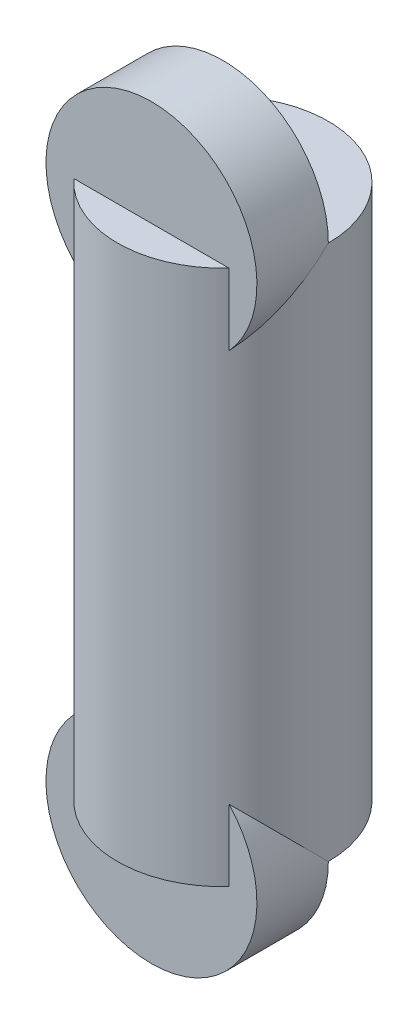
ISO-10303-21;
HEADER;
FILE_DESCRIPTION(('STEP AP214'),'2;1');
FILE_NAME('part.step','',(''),(''),'','','');
FILE_SCHEMA(('AUTOMOTIVE_DESIGN { 1 0 10303 214 1 1 1 1 }'));
ENDSEC;
DATA;
#1=APPLICATION_CONTEXT('core data for automotive mechanical design processes');
#2=APPLICATION_PROTOCOL_DEFINITION('international standard','automotive_design',2000,#1);
#3=PRODUCT_CONTEXT('',#1,'mechanical');
#4=PRODUCT('Part','Part','',(#3));
#5=PRODUCT_RELATED_PRODUCT_CATEGORY('part','',(#4));
#6=PRODUCT_DEFINITION_FORMATION('','',#4);
#7=PRODUCT_DEFINITION_CONTEXT('part definition',#1,'design');
#8=PRODUCT_DEFINITION('design','',#6,#7);
#9=PRODUCT_DEFINITION_SHAPE('','',#8);
#10=(LENGTH_UNIT() NAMED_UNIT(*) SI_UNIT(.MILLI.,.METRE.));
#11=(NAMED_UNIT(*) PLANE_ANGLE_UNIT() SI_UNIT($,.RADIAN.));
#12=(NAMED_UNIT(*) SI_UNIT($,.STERADIAN.) SOLID_ANGLE_UNIT());
#13=UNCERTAINTY_MEASURE_WITH_UNIT(LENGTH_MEASURE(1.E-05),#10,'distance_accuracy_value','');
#14=(GEOMETRIC_REPRESENTATION_CONTEXT(3) GLOBAL_UNCERTAINTY_ASSIGNED_CONTEXT((#13)) GLOBAL_UNIT_ASSIGNED_CONTEXT((#10,
#11,#12)) REPRESENTATION_CONTEXT('',''));
#15=CARTESIAN_POINT('',(0.,0.,0.));
#16=DIRECTION('',(0.,0.,1.));
#17=DIRECTION('',(1.,0.,0.));
#18=AXIS2_PLACEMENT_3D('',#15,#16,#17);
#19=CARTESIAN_POINT('',(0.,46.0659340659341,0.));
#20=DIRECTION('',(0.,1.,0.));
#21=DIRECTION('',(0.,0.,1.));
#22=AXIS2_PLACEMENT_3D('',#19,#20,#21);
#23=CYLINDRICAL_SURFACE('',#22,15.1208791208791);
#24=DIRECTION('',(0.,1.,0.));
#25=VECTOR('',#24,1.);
#26=CARTESIAN_POINT('',(15.1208791208791,46.0659340659341,0.));
#27=LINE('',#26,#25);
#28=CARTESIAN_POINT('',(15.1208791208791,116.065934065934,0.));
#29=VERTEX_POINT('',#28);
#30=CARTESIAN_POINT('',(15.1208791208791,90.6911488516523,0.));
#31=VERTEX_POINT('',#30);
#32=EDGE_CURVE('E221',#29,#31,#27,.F.);
#33=ORIENTED_EDGE('',*,*,#32,.F.);
#34=CARTESIAN_POINT('',(0.,116.065934065934,0.));
#35=DIRECTION('',(0.,1.,0.));
#36=DIRECTION('',(0.,0.,1.));
#37=AXIS2_PLACEMENT_3D('',#34,#35,#36);
#38=CIRCLE('',#37,15.1208791208791);
#39=CARTESIAN_POINT('',(-15.1208791208791,116.065934065934,0.));
#40=VERTEX_POINT('',#39);
#41=EDGE_CURVE('E199',#29,#40,#38,.T.);
#42=ORIENTED_EDGE('',*,*,#41,.T.);
#43=DIRECTION('',(0.,1.,0.));
#44=VECTOR('',#43,1.);
#45=CARTESIAN_POINT('',(-15.1208791208791,46.0659340659341,0.));
#46=LINE('',#45,#44);
#47=CARTESIAN_POINT('',(-15.1208791208791,90.6911488516523,0.));
#48=VERTEX_POINT('',#47);
#49=EDGE_CURVE('E242',#48,#40,#46,.T.);
#50=ORIENTED_EDGE('',*,*,#49,.F.);
#51=CARTESIAN_POINT('',(15.1208791208791,90.6911488516523,0.));
#52=CARTESIAN_POINT('',(15.1208806754029,90.6911535987163,0.197270184569811));
#53=CARTESIAN_POINT('',(15.1170178169914,90.688847432266,0.394512241172447));
#54=CARTESIAN_POINT('',(15.101589618207,90.67966181819,0.788579568573192));
#55=CARTESIAN_POINT('',(15.0900246233496,90.672782575711,0.985404857670053));
#56=CARTESIAN_POINT('',(15.0438426838605,90.6453739109189,1.5743937410107));
#57=CARTESIAN_POINT('',(14.9977386824241,90.6180733811267,1.96542069024204));
#58=CARTESIAN_POINT('',(14.875903839298,90.5466649165317,2.73877195734138));
#59=CARTESIAN_POINT('',(14.8003516640514,90.5026583806942,3.12113431354278));
#60=CARTESIAN_POINT('',(14.6205627374541,90.3994075261834,3.87698953014893));
#61=CARTESIAN_POINT('',(14.5163224569884,90.340161332837,4.25048129317829));
#62=CARTESIAN_POINT('',(14.2806064896987,90.2085726977698,4.985363306735));
#63=CARTESIAN_POINT('',(14.1491953382914,90.136261338457,5.3467799169915));
#64=CARTESIAN_POINT('',(13.8602402984063,89.9806632141203,6.05652911444965));
#65=CARTESIAN_POINT('',(13.7026967861347,89.8973766071015,6.40486188991996));
#66=CARTESIAN_POINT('',(13.3624926299151,89.7220324114235,7.08733821699156));
#67=CARTESIAN_POINT('',(13.1797979993233,89.6299630071833,7.42146175416351));
#68=CARTESIAN_POINT('',(12.7905927452458,89.439473548141,8.07378739381283));
#69=CARTESIAN_POINT('',(12.5840733428763,89.3410511583309,8.39198356509538));
#70=CARTESIAN_POINT('',(12.1296900478013,89.1315851478318,9.03772943943587));
#71=CARTESIAN_POINT('',(11.879798955305,89.0201832944581,9.36373797174608));
#72=CARTESIAN_POINT('',(11.3546883330764,88.7955597852089,9.99401349893743));
#73=CARTESIAN_POINT('',(11.0794674604021,88.6823380331086,10.2982793395368));
#74=CARTESIAN_POINT('',(10.5048971417835,88.456821082367,10.8837683965562));
#75=CARTESIAN_POINT('',(10.2055373073444,88.3445263058264,11.1649815858648));
#76=CARTESIAN_POINT('',(9.58425402079324,88.1236463016022,11.7026396450027));
#77=CARTESIAN_POINT('',(9.26233813855738,88.0150598474193,11.9590927563309));
#78=CARTESIAN_POINT('',(8.57334114107716,87.7965454195539,12.463301923913));
#79=CARTESIAN_POINT('',(8.20467691734837,87.6870834833123,12.7091032500311));
#80=CARTESIAN_POINT('',(7.44500649756936,87.4783888590403,13.168519333292));
#81=CARTESIAN_POINT('',(7.05399893913769,87.3791567958115,13.3821321248493));
#82=CARTESIAN_POINT('',(6.25229685707352,87.1938255538368,13.7749375588821));
#83=CARTESIAN_POINT('',(5.84161223647847,87.1077198582536,13.9541472929501));
#84=CARTESIAN_POINT('',(5.00333362256573,86.9511770256187,14.2761748958135));
#85=CARTESIAN_POINT('',(4.57574153477429,86.8807381287626,14.418996852201));
#86=CARTESIAN_POINT('',(3.73926456615015,86.7622886656204,14.6572086780679));
#87=CARTESIAN_POINT('',(3.33133599981169,86.7130043542708,14.7553259294967));
#88=CARTESIAN_POINT('',(2.5071029786309,86.6311484746811,14.917499548565));
#89=CARTESIAN_POINT('',(2.09079890305109,86.5985761514457,14.9815574549041));
#90=CARTESIAN_POINT('',(1.25351336278734,86.5511047043896,15.0747150533692));
#91=CARTESIAN_POINT('',(0.832534453997687,86.5361963610634,15.1038329821048));
#92=CARTESIAN_POINT('',(-0.0106244412038454,86.5244663981938,15.126754268031));
#93=CARTESIAN_POINT('',(-0.432804347634086,86.5276436011615,15.1205599242842));
#94=CARTESIAN_POINT('',(-1.23622342271919,86.5508703149209,15.0751310819046));
#95=CARTESIAN_POINT('',(-1.61768590587035,86.5693551171164,15.03896044218));
#96=CARTESIAN_POINT('',(-2.37578918126381,86.6207197185814,14.9379656558051));
#97=CARTESIAN_POINT('',(-2.75243032778531,86.6535984538402,14.873143627084));
#98=CARTESIAN_POINT('',(-3.49834956875793,86.7329669640238,14.7155652371847));
#99=CARTESIAN_POINT('',(-3.86762755939533,86.7794569307096,14.6228084824491));
#100=CARTESIAN_POINT('',(-4.59649850157084,86.8849723119577,14.4103193472919));
#101=CARTESIAN_POINT('',(-4.95609109788131,86.9439981855913,14.2905859789632));
#102=CARTESIAN_POINT('',(-5.66818139694421,87.0741220289376,14.0235235880615));
#103=CARTESIAN_POINT('',(-6.02052291493882,87.1453689875159,13.8758513467822));
#104=CARTESIAN_POINT('',(-6.71126236286397,87.2978132182824,13.5552548137961));
#105=CARTESIAN_POINT('',(-7.04966031682189,87.3790104733233,13.3823305656056));
#106=CARTESIAN_POINT('',(-7.71095819944778,87.5496498689415,13.0125189807379));
#107=CARTESIAN_POINT('',(-8.03385640281879,87.639092924148,12.8156289849875));
#108=CARTESIAN_POINT('',(-8.66285235860811,87.8244175748868,12.3991257851831));
#109=CARTESIAN_POINT('',(-8.9689440085661,87.9203014813609,12.1795044097853));
#110=CARTESIAN_POINT('',(-9.59202128292905,88.1261466475454,11.6963380590945));
#111=CARTESIAN_POINT('',(-9.90715485505273,88.2365685327098,11.430598210718));
#112=CARTESIAN_POINT('',(-10.5141883889724,88.4601881592751,10.874842418561));
#113=CARTESIAN_POINT('',(-10.8060866992223,88.5733860972492,10.5848247521308));
#114=CARTESIAN_POINT('',(-11.3656062216909,88.7999313473224,9.98165221320963));
#115=CARTESIAN_POINT('',(-11.6332002719128,88.9132786863456,9.66847214683058));
#116=CARTESIAN_POINT('',(-12.1423095420041,89.1370956299422,9.02080484978199));
#117=CARTESIAN_POINT('',(-12.3838335004098,89.247566189315,8.68632481887718));
#118=CARTESIAN_POINT('',(-12.8554498221742,89.4702426601823,7.97330754501734));
#119=CARTESIAN_POINT('',(-13.0835617150461,89.5820297141027,7.59332505454415));
#120=CARTESIAN_POINT('',(-13.5066174904971,89.7952631653124,6.8124484882458));
#121=CARTESIAN_POINT('',(-13.701556847558,89.8967081509434,6.41155156892985));
#122=CARTESIAN_POINT('',(-14.0558684990173,90.0852972924062,5.59216788121654));
#123=CARTESIAN_POINT('',(-14.2153184046569,90.1724725416929,5.17372192216725));
#124=CARTESIAN_POINT('',(-14.4971594314018,90.3292061974674,4.32141147463379));
#125=CARTESIAN_POINT('',(-14.6195664852651,90.3987721758892,3.88755370501067));
#126=CARTESIAN_POINT('',(-14.7882169518892,90.4957361440433,3.16743636248387));
#127=CARTESIAN_POINT('',(-14.845987601426,90.5292805767428,2.88464460503212));
#128=CARTESIAN_POINT('',(-14.9453508612633,90.5873056010711,2.31536445027528));
#129=CARTESIAN_POINT('',(-14.9869479699366,90.6117887128482,2.02887710376657));
#130=CARTESIAN_POINT('',(-15.0537321122866,90.6512246962112,1.45271476792646));
#131=CARTESIAN_POINT('',(-15.0788835547367,90.6661568964849,1.16303423563829));
#132=CARTESIAN_POINT('',(-15.1124720715017,90.6861396976552,0.582241438493384));
#133=CARTESIAN_POINT('',(-15.1209018466326,90.691185983234,0.291128603979581));
#134=CARTESIAN_POINT('',(-15.1208791208791,90.6911488516523,0.));
#135=B_SPLINE_CURVE_WITH_KNOTS('',3,(#51,#52,#53,#54,#55,#56,#57,#58,#59,#60,#61,#62,#63,#64,
#65,#66,#67,#68,#69,#70,#71,#72,#73,#74,#75,#76,#77,#78,#79,#80,#81,#82,#83,#84,#85,#86,#87,#88,
#89,#90,#91,#92,#93,#94,#95,#96,#97,#98,#99,#100,#101,#102,#103,#104,#105,#106,#107,#108,#109,
#110,#111,#112,#113,#114,#115,#116,#117,#118,#119,#120,#121,#122,#123,#124,#125,#126,#127,#128,
#129,#130,#131,#132,#133,#134),.UNSPECIFIED.,.F.,.F.,(4,2,2,2,2,2,2,2,2,2,2,2,2,2,2,2,2,2,2,2,2,
2,2,2,2,2,2,2,2,2,2,2,2,2,2,2,2,2,2,2,2,4),(0.,0.591703736424877,1.1833809309867,
2.36568822259329,3.54093122300126,4.71631886255657,5.88894618341301,7.06155662438543,
8.23576745527521,9.4104123463778,10.685874422851,11.9614041611657,13.2374857993325,
14.5131412131933,15.880618350303,17.2481789582823,18.6150583877489,19.9817842021362,
21.2473982638022,22.5129551439412,23.7778511902421,25.0426648843838,26.1921617830446,
27.3415737243571,28.4910018598757,29.6404720952973,30.8051067957988,31.9697394893317,
33.1345015204178,34.2996837172167,35.5785769298283,36.8575609642495,38.1379572182442,
39.4179229496306,40.787395478572,42.1570546864239,43.5236885206596,44.8897337043334,
45.7609105923679,46.6318450049651,47.5046580838903,48.3778520711557),.UNSPECIFIED.);
#136=EDGE_CURVE('E191',#31,#48,#135,.T.);
#137=ORIENTED_EDGE('',*,*,#136,.F.);
#138=EDGE_LOOP('',(#33,#42,#50,#137));
#139=FACE_BOUND('',#138,.T.);
#140=DIRECTION('',(0.,1.,0.));
#141=VECTOR('',#140,1.);
#142=CARTESIAN_POINT('',(15.1208791208791,46.0659340659341,0.));
#143=LINE('',#142,#141);
#144=CARTESIAN_POINT('',(15.1208791208791,-8.55928071978414,0.));
#145=VERTEX_POINT('',#144);
#146=CARTESIAN_POINT('',(15.1208791208791,-33.9340659340659,0.));
#147=VERTEX_POINT('',#146);
#148=EDGE_CURVE('E52',#145,#147,#143,.F.);
#149=ORIENTED_EDGE('',*,*,#148,.F.);
#150=CARTESIAN_POINT('',(-15.1208791208791,-8.55928071978414,0.));
#151=CARTESIAN_POINT('',(-15.1208806754029,-8.55928546684811,0.197270184569811));
#152=CARTESIAN_POINT('',(-15.1170178169914,-8.55697930039786,0.394512241172447));
#153=CARTESIAN_POINT('',(-15.101589618207,-8.54779368632182,0.788579568573193));
#154=CARTESIAN_POINT('',(-15.0900246233496,-8.54091444384287,0.985404857670054));
#155=CARTESIAN_POINT('',(-15.0438426838605,-8.51350577905078,1.5743937410107));
#156=CARTESIAN_POINT('',(-14.9977386824241,-8.4862052492586,1.96542069024205));
#157=CARTESIAN_POINT('',(-14.875903839298,-8.41479678466359,2.73877195734138));
#158=CARTESIAN_POINT('',(-14.8003516640514,-8.37079024882603,3.12113431354278));
#159=CARTESIAN_POINT('',(-14.6205627374541,-8.26753939431525,3.87698953014893));
#160=CARTESIAN_POINT('',(-14.5163224569884,-8.20829320096884,4.25048129317829));
#161=CARTESIAN_POINT('',(-14.2806064896987,-8.07670456590167,4.985363306735));
#162=CARTESIAN_POINT('',(-14.1491953382914,-8.00439320658889,5.3467799169915));
#163=CARTESIAN_POINT('',(-13.8602402984063,-7.84879508225216,6.05652911444965));
#164=CARTESIAN_POINT('',(-13.7026967861347,-7.76550847523335,6.40486188991996));
#165=CARTESIAN_POINT('',(-13.3624926299151,-7.59016427955538,7.08733821699156));
#166=CARTESIAN_POINT('',(-13.1797979993233,-7.49809487531519,7.42146175416351));
#167=CARTESIAN_POINT('',(-12.7905927452458,-7.30760541627287,8.07378739381283));
#168=CARTESIAN_POINT('',(-12.5840733428763,-7.2091830264627,8.39198356509538));
#169=CARTESIAN_POINT('',(-12.1296900478013,-6.99971701596368,9.03772943943587));
#170=CARTESIAN_POINT('',(-11.879798955305,-6.8883151625899,9.36373797174608));
#171=CARTESIAN_POINT('',(-11.3546883330764,-6.66369165334077,9.99401349893743));
#172=CARTESIAN_POINT('',(-11.0794674604021,-6.55046990124043,10.2982793395368));
#173=CARTESIAN_POINT('',(-10.5048971417835,-6.3249529504989,10.8837683965562));
#174=CARTESIAN_POINT('',(-10.2055373073444,-6.21265817395825,11.1649815858648));
#175=CARTESIAN_POINT('',(-9.58425402079325,-5.99177816973404,11.7026396450027));
#176=CARTESIAN_POINT('',(-9.26233813855739,-5.88319171555116,11.9590927563309));
#177=CARTESIAN_POINT('',(-8.57334114107716,-5.66467728768578,12.463301923913));
#178=CARTESIAN_POINT('',(-8.20467691734837,-5.55521535144419,12.7091032500311));
#179=CARTESIAN_POINT('',(-7.44500649756937,-5.34652072717217,13.168519333292));
#180=CARTESIAN_POINT('',(-7.0539989391377,-5.24728866394337,13.3821321248493));
#181=CARTESIAN_POINT('',(-6.25229685707352,-5.06195742196867,13.7749375588821));
#182=CARTESIAN_POINT('',(-5.84161223647847,-4.9758517263855,13.9541472929501));
#183=CARTESIAN_POINT('',(-5.00333362256573,-4.81930889375057,14.2761748958135));
#184=CARTESIAN_POINT('',(-4.57574153477429,-4.74886999689448,14.418996852201));
#185=CARTESIAN_POINT('',(-3.73926456615015,-4.63042053375224,14.6572086780679));
#186=CARTESIAN_POINT('',(-3.33133599981169,-4.58113622240261,14.7553259294967));
#187=CARTESIAN_POINT('',(-2.5071029786309,-4.49928034281298,14.917499548565));
#188=CARTESIAN_POINT('',(-2.09079890305109,-4.46670801957755,14.9815574549041));
#189=CARTESIAN_POINT('',(-1.25351336278734,-4.41923657252143,15.0747150533692));
#190=CARTESIAN_POINT('',(-0.832534453997685,-4.40432822919526,15.1038329821048));
#191=CARTESIAN_POINT('',(0.0106244412038467,-4.3925982663256,15.126754268031));
#192=CARTESIAN_POINT('',(0.432804347634087,-4.39577546929339,15.1205599242842));
#193=CARTESIAN_POINT('',(1.23622342271919,-4.41900218305271,15.0751310819046));
#194=CARTESIAN_POINT('',(1.61768590587035,-4.43748698524829,15.03896044218));
#195=CARTESIAN_POINT('',(2.3757891812638,-4.48885158671326,14.9379656558051));
#196=CARTESIAN_POINT('',(2.75243032778531,-4.52173032197209,14.873143627084));
#197=CARTESIAN_POINT('',(3.49834956875792,-4.60109883215563,14.7155652371847));
#198=CARTESIAN_POINT('',(3.86762755939533,-4.64758879884143,14.6228084824491));
#199=CARTESIAN_POINT('',(4.59649850157084,-4.75310418008957,14.4103193472919));
#200=CARTESIAN_POINT('',(4.95609109788132,-4.81213005372321,14.2905859789632));
#201=CARTESIAN_POINT('',(5.66818139694421,-4.94225389706944,14.0235235880615));
#202=CARTESIAN_POINT('',(6.02052291493882,-5.01350085564778,13.8758513467822));
#203=CARTESIAN_POINT('',(6.71126236286397,-5.16594508641422,13.5552548137961));
#204=CARTESIAN_POINT('',(7.04966031682189,-5.24714234145513,13.3823305656056));
#205=CARTESIAN_POINT('',(7.71095819944779,-5.41778173707334,13.0125189807379));
#206=CARTESIAN_POINT('',(8.0338564028188,-5.50722479227981,12.8156289849875));
#207=CARTESIAN_POINT('',(8.66285235860812,-5.69254944301861,12.3991257851831));
#208=CARTESIAN_POINT('',(8.9689440085661,-5.78843334949275,12.1795044097853));
#209=CARTESIAN_POINT('',(9.59202128292906,-5.99427851567723,11.6963380590945));
#210=CARTESIAN_POINT('',(9.90715485505273,-6.10470040084161,11.430598210718));
#211=CARTESIAN_POINT('',(10.5141883889724,-6.32832002740695,10.874842418561));
#212=CARTESIAN_POINT('',(10.8060866992223,-6.44151796538107,10.5848247521308));
#213=CARTESIAN_POINT('',(11.3656062216909,-6.66806321545423,9.98165221320963));
#214=CARTESIAN_POINT('',(11.6332002719128,-6.78141055447745,9.66847214683058));
#215=CARTESIAN_POINT('',(12.1423095420041,-7.00522749807404,9.020804849782));
#216=CARTESIAN_POINT('',(12.3838335004098,-7.11569805744686,8.68632481887718));
#217=CARTESIAN_POINT('',(12.8554498221742,-7.33837452831415,7.97330754501734));
#218=CARTESIAN_POINT('',(13.0835617150461,-7.45016158223459,7.59332505454414));
#219=CARTESIAN_POINT('',(13.5066174904971,-7.66339503344427,6.8124484882458));
#220=CARTESIAN_POINT('',(13.701556847558,-7.76484001907528,6.41155156892984));
#221=CARTESIAN_POINT('',(14.0558684990173,-7.95342916053805,5.59216788121653));
#222=CARTESIAN_POINT('',(14.2153184046569,-8.04060440982473,5.17372192216724));
#223=CARTESIAN_POINT('',(14.4971594314018,-8.19733806559926,4.32141147463379));
#224=CARTESIAN_POINT('',(14.6195664852651,-8.26690404402109,3.88755370501067));
#225=CARTESIAN_POINT('',(14.7882169518892,-8.3638680121752,3.16743636248387));
#226=CARTESIAN_POINT('',(14.845987601426,-8.39741244487464,2.88464460503211));
#227=CARTESIAN_POINT('',(14.9453508612633,-8.45543746920291,2.31536445027527));
#228=CARTESIAN_POINT('',(14.9869479699366,-8.47992058098007,2.02887710376657));
#229=CARTESIAN_POINT('',(15.0537321122866,-8.51935656434306,1.45271476792645));
#230=CARTESIAN_POINT('',(15.0788835547367,-8.5342887646168,1.16303423563829));
#231=CARTESIAN_POINT('',(15.1124720715017,-8.55427156578711,0.582241438493384));
#232=CARTESIAN_POINT('',(15.1209018466326,-8.55931785136585,0.291128603979582));
#233=CARTESIAN_POINT('',(15.1208791208791,-8.55928071978414,0.));
#234=B_SPLINE_CURVE_WITH_KNOTS('',3,(#150,#151,#152,#153,#154,#155,#156,#157,#158,#159,#160,
#161,#162,#163,#164,#165,#166,#167,#168,#169,#170,#171,#172,#173,#174,#175,#176,#177,#178,#179,
#180,#181,#182,#183,#184,#185,#186,#187,#188,#189,#190,#191,#192,#193,#194,#195,#196,#197,#198,
#199,#200,#201,#202,#203,#204,#205,#206,#207,#208,#209,#210,#211,#212,#213,#214,#215,#216,#217,
#218,#219,#220,#221,#222,#223,#224,#225,#226,#227,#228,#229,#230,#231,#232,#233),.UNSPECIFIED.,
.F.,.F.,(4,2,2,2,2,2,2,2,2,2,2,2,2,2,2,2,2,2,2,2,2,2,2,2,2,2,2,2,2,2,2,2,2,2,2,2,2,2,2,2,2,4),
(0.,0.591703736424877,1.1833809309867,2.36568822259329,3.54093122300126,4.71631886255657,
5.88894618341301,7.06155662438543,8.23576745527521,9.4104123463778,10.685874422851,
11.9614041611657,13.2374857993325,14.5131412131933,15.880618350303,17.2481789582823,
18.6150583877489,19.9817842021362,21.2473982638022,22.5129551439412,23.7778511902421,
25.0426648843838,26.1921617830446,27.3415737243571,28.4910018598757,29.6404720952973,
30.8051067957988,31.9697394893317,33.1345015204179,34.2996837172167,35.5785769298283,
36.8575609642495,38.1379572182442,39.4179229496306,40.787395478572,42.157054686424,
43.5236885206596,44.8897337043334,45.7609105923679,46.6318450049651,47.5046580838903,
48.3778520711557),.UNSPECIFIED.);
#235=CARTESIAN_POINT('',(-15.1208791208791,-8.55928071978414,0.));
#236=VERTEX_POINT('',#235);
#237=EDGE_CURVE('E56',#236,#145,#234,.T.);
#238=ORIENTED_EDGE('',*,*,#237,.F.);
#239=DIRECTION('',(0.,1.,0.));
#240=VECTOR('',#239,1.);
#241=CARTESIAN_POINT('',(-15.1208791208791,46.0659340659341,0.));
#242=LINE('',#241,#240);
#243=CARTESIAN_POINT('',(-15.1208791208791,-33.9340659340659,0.));
#244=VERTEX_POINT('',#243);
#245=EDGE_CURVE('E149',#244,#236,#242,.T.);
#246=ORIENTED_EDGE('',*,*,#245,.F.);
#247=CARTESIAN_POINT('',(0.,-33.9340659340659,0.));
#248=DIRECTION('',(0.,1.,0.));
#249=DIRECTION('',(0.,0.,1.));
#250=AXIS2_PLACEMENT_3D('',#247,#248,#249);
#251=CIRCLE('',#250,15.1208791208791);
#252=EDGE_CURVE('E120',#147,#244,#251,.T.);
#253=ORIENTED_EDGE('',*,*,#252,.F.);
#254=EDGE_LOOP('',(#149,#238,#246,#253));
#255=FACE_BOUND('',#254,.T.);
#256=ADVANCED_FACE('F37',(#139,#255),#23,.F.);
#257=CARTESIAN_POINT('',(0.,46.0659340659341,0.));
#258=DIRECTION('',(0.,1.,0.));
#259=DIRECTION('',(0.,0.,1.));
#260=AXIS2_PLACEMENT_3D('',#257,#258,#259);
#261=CYLINDRICAL_SURFACE('',#260,29.5384615384615);
#262=CARTESIAN_POINT('',(0.,116.065934065934,0.));
#263=DIRECTION('',(0.,0.707106781186547,0.707106781186547));
#264=DIRECTION('',(0.,0.707106781186547,-0.707106781186547));
#265=AXIS2_PLACEMENT_3D('',#262,#263,#264);
#266=ELLIPSE('',#265,41.7736929193283,29.5384615384615);
#267=CARTESIAN_POINT('',(21.7375414906831,96.0659340659341,20.));
#268=VERTEX_POINT('',#267);
#269=CARTESIAN_POINT('',(29.5384615384615,116.065934065934,0.));
#270=VERTEX_POINT('',#269);
#271=EDGE_CURVE('E201',#268,#270,#266,.T.);
#272=ORIENTED_EDGE('',*,*,#271,.F.);
#273=DIRECTION('',(0.,1.,0.));
#274=VECTOR('',#273,1.);
#275=CARTESIAN_POINT('',(21.7375414906831,46.0659340659341,20.));
#276=LINE('',#275,#274);
#277=CARTESIAN_POINT('',(21.7375414906831,116.065934065934,20.));
#278=VERTEX_POINT('',#277);
#279=EDGE_CURVE('E237',#268,#278,#276,.T.);
#280=ORIENTED_EDGE('',*,*,#279,.T.);
#281=CARTESIAN_POINT('',(0.,116.065934065934,0.));
#282=DIRECTION('',(0.,1.,0.));
#283=DIRECTION('',(0.,0.,1.));
#284=AXIS2_PLACEMENT_3D('',#281,#282,#283);
#285=CIRCLE('',#284,29.5384615384615);
#286=CARTESIAN_POINT('',(-21.7375414906831,116.065934065934,20.));
#287=VERTEX_POINT('',#286);
#288=EDGE_CURVE('E205',#287,#278,#285,.T.);
#289=ORIENTED_EDGE('',*,*,#288,.F.);
#290=DIRECTION('',(0.,1.,0.));
#291=VECTOR('',#290,1.);
#292=CARTESIAN_POINT('',(-21.7375414906831,46.0659340659341,20.));
#293=LINE('',#292,#291);
#294=CARTESIAN_POINT('',(-21.7375414906831,96.0659340659341,20.));
#295=VERTEX_POINT('',#294);
#296=EDGE_CURVE('E238',#287,#295,#293,.F.);
#297=ORIENTED_EDGE('',*,*,#296,.T.);
#298=CARTESIAN_POINT('',(-29.5384615384615,116.065934065934,0.));
#299=VERTEX_POINT('',#298);
#300=EDGE_CURVE('E200',#299,#295,#266,.T.);
#301=ORIENTED_EDGE('',*,*,#300,.F.);
#302=EDGE_CURVE('E207',#270,#299,#285,.T.);
#303=ORIENTED_EDGE('',*,*,#302,.F.);
#304=EDGE_LOOP('',(#272,#280,#289,#297,#301,#303));
#305=FACE_BOUND('',#304,.T.);
#306=CARTESIAN_POINT('',(0.,-33.9340659340659,0.));
#307=DIRECTION('',(0.,0.707106781186547,-0.707106781186547));
#308=DIRECTION('',(0.,0.707106781186547,0.707106781186547));
#309=AXIS2_PLACEMENT_3D('',#306,#307,#308);
#310=ELLIPSE('',#309,41.7736929193283,29.5384615384615);
#311=CARTESIAN_POINT('',(29.5384615384615,-33.9340659340659,0.));
#312=VERTEX_POINT('',#311);
#313=CARTESIAN_POINT('',(21.7375414906831,-13.9340659340659,20.));
#314=VERTEX_POINT('',#313);
#315=EDGE_CURVE('E124',#312,#314,#310,.F.);
#316=ORIENTED_EDGE('',*,*,#315,.F.);
#317=CARTESIAN_POINT('',(0.,-33.9340659340659,0.));
#318=DIRECTION('',(0.,1.,0.));
#319=DIRECTION('',(0.,0.,1.));
#320=AXIS2_PLACEMENT_3D('',#317,#318,#319);
#321=CIRCLE('',#320,29.5384615384615);
#322=CARTESIAN_POINT('',(-29.5384615384615,-33.9340659340659,0.));
#323=VERTEX_POINT('',#322);
#324=EDGE_CURVE('E111',#312,#323,#321,.T.);
#325=ORIENTED_EDGE('',*,*,#324,.T.);
#326=CARTESIAN_POINT('',(-21.7375414906831,-13.9340659340659,20.));
#327=VERTEX_POINT('',#326);
#328=EDGE_CURVE('E133',#327,#323,#310,.F.);
#329=ORIENTED_EDGE('',*,*,#328,.F.);
#330=DIRECTION('',(0.,1.,0.));
#331=VECTOR('',#330,1.);
#332=CARTESIAN_POINT('',(-21.7375414906831,46.0659340659341,20.));
#333=LINE('',#332,#331);
#334=CARTESIAN_POINT('',(-21.7375414906831,-33.9340659340659,20.));
#335=VERTEX_POINT('',#334);
#336=EDGE_CURVE('E151',#327,#335,#333,.F.);
#337=ORIENTED_EDGE('',*,*,#336,.T.);
#338=CARTESIAN_POINT('',(21.7375414906831,-33.9340659340659,20.));
#339=VERTEX_POINT('',#338);
#340=EDGE_CURVE('E121',#335,#339,#321,.T.);
#341=ORIENTED_EDGE('',*,*,#340,.T.);
#342=DIRECTION('',(0.,1.,0.));
#343=VECTOR('',#342,1.);
#344=CARTESIAN_POINT('',(21.7375414906831,46.0659340659341,20.));
#345=LINE('',#344,#343);
#346=EDGE_CURVE('E128',#339,#314,#345,.T.);
#347=ORIENTED_EDGE('',*,*,#346,.T.);
#348=EDGE_LOOP('',(#316,#325,#329,#337,#341,#347));
#349=FACE_BOUND('',#348,.T.);
#350=ADVANCED_FACE('F125',(#305,#349),#261,.T.);
#351=CARTESIAN_POINT('',(15.1208791208791,-33.9340659340659,0.));
#352=DIRECTION('',(0.,1.,0.));
#353=DIRECTION('',(0.,0.,1.));
#354=AXIS2_PLACEMENT_3D('',#351,#352,#353);
#355=PLANE('',#354);
#356=DIRECTION('',(1.,0.,0.));
#357=VECTOR('',#356,1.);
#358=CARTESIAN_POINT('',(15.1208791208791,-33.9340659340659,0.));
#359=LINE('',#358,#357);
#360=EDGE_CURVE('E45',#323,#244,#359,.T.);
#361=ORIENTED_EDGE('',*,*,#360,.F.);
#362=ORIENTED_EDGE('',*,*,#324,.F.);
#363=EDGE_CURVE('E116',#147,#312,#359,.T.);
#364=ORIENTED_EDGE('',*,*,#363,.F.);
#365=ORIENTED_EDGE('',*,*,#252,.T.);
#366=EDGE_LOOP('',(#361,#362,#364,#365));
#367=FACE_BOUND('',#366,.T.);
#368=ADVANCED_FACE('F113',(#367),#355,.F.);
#369=CARTESIAN_POINT('',(15.1208791208791,116.065934065934,0.));
#370=DIRECTION('',(0.,-1.,0.));
#371=DIRECTION('',(0.,0.,-1.));
#372=AXIS2_PLACEMENT_3D('',#369,#370,#371);
#373=PLANE('',#372);
#374=DIRECTION('',(-1.,0.,0.));
#375=VECTOR('',#374,1.);
#376=CARTESIAN_POINT('',(15.1208791208791,116.065934065934,0.));
#377=LINE('',#376,#375);
#378=EDGE_CURVE('E213',#270,#29,#377,.T.);
#379=ORIENTED_EDGE('',*,*,#378,.F.);
#380=ORIENTED_EDGE('',*,*,#302,.T.);
#381=EDGE_CURVE('E210',#40,#299,#377,.T.);
#382=ORIENTED_EDGE('',*,*,#381,.F.);
#383=ORIENTED_EDGE('',*,*,#41,.F.);
#384=EDGE_LOOP('',(#379,#380,#382,#383));
#385=FACE_BOUND('',#384,.T.);
#386=ADVANCED_FACE('F228',(#385),#373,.F.);
#387=ORIENTED_EDGE('',*,*,#340,.F.);
#388=DIRECTION('',(1.,0.,0.));
#389=VECTOR('',#388,1.);
#390=CARTESIAN_POINT('',(15.1208791208791,-33.9340659340659,20.));
#391=LINE('',#390,#389);
#392=EDGE_CURVE('E11',#335,#339,#391,.T.);
#393=ORIENTED_EDGE('',*,*,#392,.T.);
#394=EDGE_LOOP('',(#387,#393));
#395=FACE_BOUND('',#394,.T.);
#396=ADVANCED_FACE('F252',(#395),#355,.F.);
#397=ORIENTED_EDGE('',*,*,#288,.T.);
#398=DIRECTION('',(-1.,0.,0.));
#399=VECTOR('',#398,1.);
#400=CARTESIAN_POINT('',(15.1208791208791,116.065934065934,20.));
#401=LINE('',#400,#399);
#402=EDGE_CURVE('E140',#278,#287,#401,.T.);
#403=ORIENTED_EDGE('',*,*,#402,.T.);
#404=EDGE_LOOP('',(#397,#403));
#405=FACE_BOUND('',#404,.T.);
#406=ADVANCED_FACE('F187',(#405),#373,.F.);
#407=CARTESIAN_POINT('',(0.,116.065934065934,20.));
#408=DIRECTION('',(0.,0.,-1.));
#409=DIRECTION('',(-1.,0.,0.));
#410=AXIS2_PLACEMENT_3D('',#407,#408,#409);
#411=CYLINDRICAL_SURFACE('',#410,29.5384615384615);
#412=CARTESIAN_POINT('',(0.,116.065934065934,0.));
#413=DIRECTION('',(0.,0.,1.));
#414=DIRECTION('',(1.,0.,0.));
#415=AXIS2_PLACEMENT_3D('',#412,#413,#414);
#416=CIRCLE('',#415,29.5384615384615);
#417=EDGE_CURVE('E160',#48,#31,#416,.T.);
#418=ORIENTED_EDGE('',*,*,#417,.T.);
#419=ORIENTED_EDGE('',*,*,#136,.T.);
#420=EDGE_LOOP('',(#418,#419));
#421=FACE_BOUND('',#420,.T.);
#422=ADVANCED_FACE('F183',(#421),#411,.T.);
#423=EDGE_CURVE('E224',#270,#299,#416,.T.);
#424=ORIENTED_EDGE('',*,*,#423,.T.);
#425=ORIENTED_EDGE('',*,*,#300,.T.);
#426=CARTESIAN_POINT('',(0.,116.065934065934,20.));
#427=DIRECTION('',(0.,0.,1.));
#428=DIRECTION('',(1.,0.,0.));
#429=AXIS2_PLACEMENT_3D('',#426,#427,#428);
#430=CIRCLE('',#429,29.5384615384615);
#431=EDGE_CURVE('E161',#268,#295,#430,.T.);
#432=ORIENTED_EDGE('',*,*,#431,.F.);
#433=ORIENTED_EDGE('',*,*,#271,.T.);
#434=EDGE_LOOP('',(#424,#425,#432,#433));
#435=FACE_BOUND('',#434,.T.);
#436=ADVANCED_FACE('F178',(#435),#411,.T.);
#437=CARTESIAN_POINT('',(0.,116.065934065934,20.));
#438=DIRECTION('',(0.,0.,1.));
#439=DIRECTION('',(1.,0.,0.));
#440=AXIS2_PLACEMENT_3D('',#437,#438,#439);
#441=PLANE('',#440);
#442=ORIENTED_EDGE('',*,*,#279,.F.);
#443=ORIENTED_EDGE('',*,*,#431,.T.);
#444=ORIENTED_EDGE('',*,*,#296,.F.);
#445=ORIENTED_EDGE('',*,*,#402,.F.);
#446=EDGE_LOOP('',(#442,#443,#444,#445));
#447=FACE_BOUND('',#446,.T.);
#448=ADVANCED_FACE('F175',(#447),#441,.T.);
#449=CARTESIAN_POINT('',(0.,116.065934065934,0.));
#450=DIRECTION('',(0.,0.,1.));
#451=DIRECTION('',(1.,0.,0.));
#452=AXIS2_PLACEMENT_3D('',#449,#450,#451);
#453=PLANE('',#452);
#454=ORIENTED_EDGE('',*,*,#378,.T.);
#455=ORIENTED_EDGE('',*,*,#32,.T.);
#456=ORIENTED_EDGE('',*,*,#417,.F.);
#457=ORIENTED_EDGE('',*,*,#49,.T.);
#458=ORIENTED_EDGE('',*,*,#381,.T.);
#459=ORIENTED_EDGE('',*,*,#423,.F.);
#460=EDGE_LOOP('',(#454,#455,#456,#457,#458,#459));
#461=FACE_BOUND('',#460,.T.);
#462=ADVANCED_FACE('F167',(#461),#453,.F.);
#463=CARTESIAN_POINT('',(0.,-33.9340659340659,20.));
#464=DIRECTION('',(0.,0.,-1.));
#465=DIRECTION('',(-1.,0.,0.));
#466=AXIS2_PLACEMENT_3D('',#463,#464,#465);
#467=CYLINDRICAL_SURFACE('',#466,29.5384615384615);
#468=CARTESIAN_POINT('',(0.,-33.9340659340659,0.));
#469=DIRECTION('',(0.,0.,1.));
#470=DIRECTION('',(1.,0.,0.));
#471=AXIS2_PLACEMENT_3D('',#468,#469,#470);
#472=CIRCLE('',#471,29.5384615384615);
#473=EDGE_CURVE('E142',#145,#236,#472,.T.);
#474=ORIENTED_EDGE('',*,*,#473,.T.);
#475=ORIENTED_EDGE('',*,*,#237,.T.);
#476=EDGE_LOOP('',(#474,#475));
#477=FACE_BOUND('',#476,.T.);
#478=ADVANCED_FACE('F163',(#477),#467,.T.);
#479=EDGE_CURVE('E138',#323,#312,#472,.T.);
#480=ORIENTED_EDGE('',*,*,#479,.T.);
#481=ORIENTED_EDGE('',*,*,#315,.T.);
#482=CARTESIAN_POINT('',(0.,-33.9340659340659,20.));
#483=DIRECTION('',(0.,0.,1.));
#484=DIRECTION('',(1.,0.,0.));
#485=AXIS2_PLACEMENT_3D('',#482,#483,#484);
#486=CIRCLE('',#485,29.5384615384615);
#487=EDGE_CURVE('E143',#327,#314,#486,.T.);
#488=ORIENTED_EDGE('',*,*,#487,.F.);
#489=ORIENTED_EDGE('',*,*,#328,.T.);
#490=EDGE_LOOP('',(#480,#481,#488,#489));
#491=FACE_BOUND('',#490,.T.);
#492=ADVANCED_FACE('F141',(#491),#467,.T.);
#493=CARTESIAN_POINT('',(0.,-33.9340659340659,20.));
#494=DIRECTION('',(0.,0.,1.));
#495=DIRECTION('',(1.,0.,0.));
#496=AXIS2_PLACEMENT_3D('',#493,#494,#495);
#497=PLANE('',#496);
#498=ORIENTED_EDGE('',*,*,#346,.F.);
#499=ORIENTED_EDGE('',*,*,#392,.F.);
#500=ORIENTED_EDGE('',*,*,#336,.F.);
#501=ORIENTED_EDGE('',*,*,#487,.T.);
#502=EDGE_LOOP('',(#498,#499,#500,#501));
#503=FACE_BOUND('',#502,.T.);
#504=ADVANCED_FACE('F171',(#503),#497,.T.);
#505=CARTESIAN_POINT('',(0.,-33.9340659340659,0.));
#506=DIRECTION('',(0.,0.,1.));
#507=DIRECTION('',(1.,0.,0.));
#508=AXIS2_PLACEMENT_3D('',#505,#506,#507);
#509=PLANE('',#508);
#510=ORIENTED_EDGE('',*,*,#360,.T.);
#511=ORIENTED_EDGE('',*,*,#245,.T.);
#512=ORIENTED_EDGE('',*,*,#473,.F.);
#513=ORIENTED_EDGE('',*,*,#148,.T.);
#514=ORIENTED_EDGE('',*,*,#363,.T.);
#515=ORIENTED_EDGE('',*,*,#479,.F.);
#516=EDGE_LOOP('',(#510,#511,#512,#513,#514,#515));
#517=FACE_BOUND('',#516,.T.);
#518=ADVANCED_FACE('F137',(#517),#509,.F.);
#519=CLOSED_SHELL('',(#256,#350,#368,#386,#396,#406,#422,#436,#448,#462,#478,#492,#504,#518));
#520=MANIFOLD_SOLID_BREP('B2',#519);
#521=ADVANCED_BREP_SHAPE_REPRESENTATION('',(#18,#520),#14);
#522=SHAPE_DEFINITION_REPRESENTATION(#9,#521);
ENDSEC;
END-ISO-10303-21;
